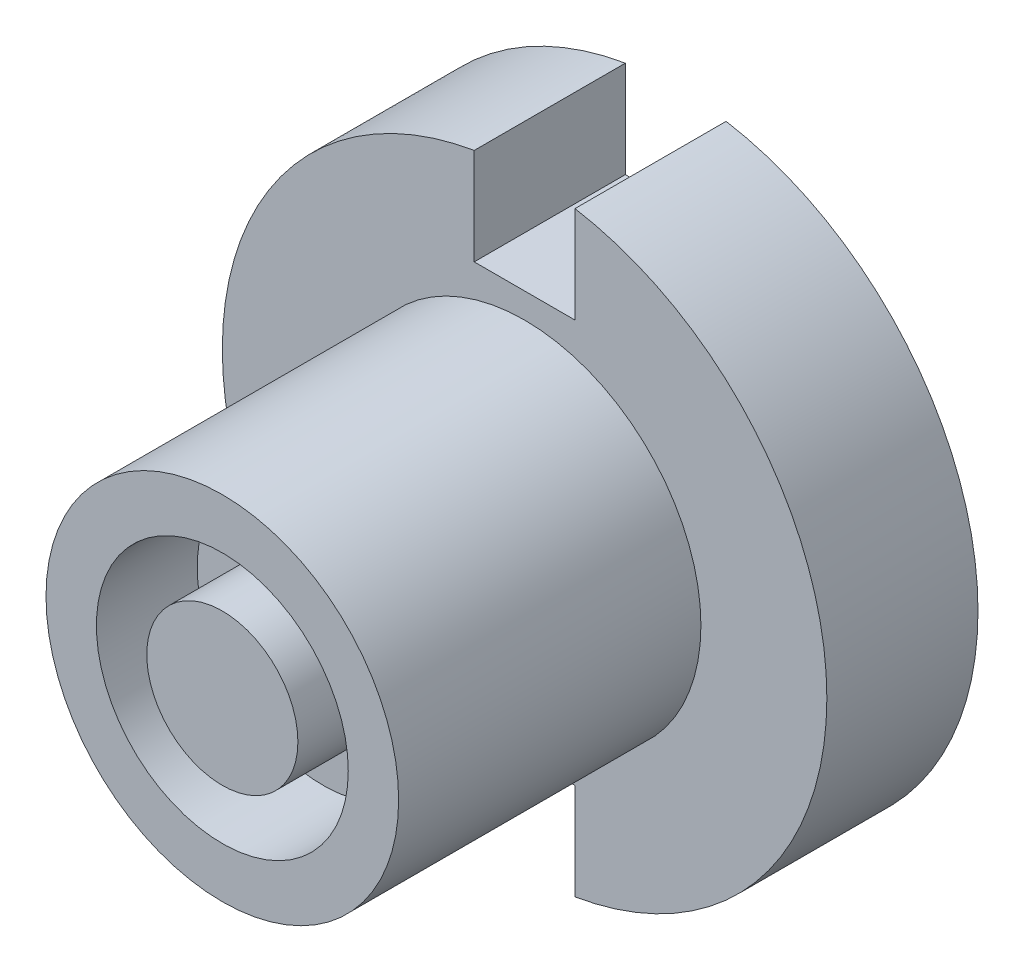
ISO-10303-21;
HEADER;
FILE_DESCRIPTION(('STEP AP214'),'2;1');
FILE_NAME('part.step','',(''),(''),'','','');
FILE_SCHEMA(('AUTOMOTIVE_DESIGN { 1 0 10303 214 1 1 1 1 }'));
ENDSEC;
DATA;
#1=APPLICATION_CONTEXT('core data for automotive mechanical design processes');
#2=APPLICATION_PROTOCOL_DEFINITION('international standard','automotive_design',2000,#1);
#3=PRODUCT_CONTEXT('',#1,'mechanical');
#4=PRODUCT('Part','Part','',(#3));
#5=PRODUCT_RELATED_PRODUCT_CATEGORY('part','',(#4));
#6=PRODUCT_DEFINITION_FORMATION('','',#4);
#7=PRODUCT_DEFINITION_CONTEXT('part definition',#1,'design');
#8=PRODUCT_DEFINITION('design','',#6,#7);
#9=PRODUCT_DEFINITION_SHAPE('','',#8);
#10=(LENGTH_UNIT() NAMED_UNIT(*) SI_UNIT(.MILLI.,.METRE.));
#11=(NAMED_UNIT(*) PLANE_ANGLE_UNIT() SI_UNIT($,.RADIAN.));
#12=(NAMED_UNIT(*) SI_UNIT($,.STERADIAN.) SOLID_ANGLE_UNIT());
#13=UNCERTAINTY_MEASURE_WITH_UNIT(LENGTH_MEASURE(1.E-05),#10,'distance_accuracy_value','');
#14=(GEOMETRIC_REPRESENTATION_CONTEXT(3) GLOBAL_UNCERTAINTY_ASSIGNED_CONTEXT((#13)) GLOBAL_UNIT_ASSIGNED_CONTEXT((#10,
#11,#12)) REPRESENTATION_CONTEXT('',''));
#15=CARTESIAN_POINT('',(0.,0.,0.));
#16=DIRECTION('',(0.,0.,1.));
#17=DIRECTION('',(1.,0.,0.));
#18=AXIS2_PLACEMENT_3D('',#15,#16,#17);
#19=CARTESIAN_POINT('',(-4.75410201159471,3.97833760996837,-3.));
#20=DIRECTION('',(0.,0.,1.));
#21=DIRECTION('',(1.,0.,0.));
#22=AXIS2_PLACEMENT_3D('',#19,#20,#21);
#23=CYLINDRICAL_SURFACE('',#22,6.);
#24=CARTESIAN_POINT('',(-4.75410201159471,3.97833760996837,0.));
#25=DIRECTION('',(0.,0.,-1.));
#26=DIRECTION('',(-1.,0.,0.));
#27=AXIS2_PLACEMENT_3D('',#24,#25,#26);
#28=CIRCLE('',#27,6.);
#29=CARTESIAN_POINT('',(-3.75410201159471,9.89441739306799,0.));
#30=VERTEX_POINT('',#29);
#31=CARTESIAN_POINT('',(-3.75410201159471,-1.93774217313124,0.));
#32=VERTEX_POINT('',#31);
#33=EDGE_CURVE('E169',#30,#32,#28,.T.);
#34=ORIENTED_EDGE('',*,*,#33,.T.);
#35=DIRECTION('',(0.,0.,1.));
#36=VECTOR('',#35,1.);
#37=CARTESIAN_POINT('',(-3.75410201159471,-1.93774217313124,-3.));
#38=LINE('',#37,#36);
#39=CARTESIAN_POINT('',(-3.75410201159471,-1.93774217313124,-3.));
#40=VERTEX_POINT('',#39);
#41=EDGE_CURVE('E48',#32,#40,#38,.F.);
#42=ORIENTED_EDGE('',*,*,#41,.T.);
#43=CARTESIAN_POINT('',(-4.75410201159471,3.97833760996837,-3.));
#44=DIRECTION('',(0.,0.,-1.));
#45=DIRECTION('',(-1.,0.,0.));
#46=AXIS2_PLACEMENT_3D('',#43,#44,#45);
#47=CIRCLE('',#46,6.);
#48=CARTESIAN_POINT('',(-3.75410201159471,9.89441739306799,-3.));
#49=VERTEX_POINT('',#48);
#50=EDGE_CURVE('E119',#49,#40,#47,.T.);
#51=ORIENTED_EDGE('',*,*,#50,.F.);
#52=DIRECTION('',(0.,0.,1.));
#53=VECTOR('',#52,1.);
#54=CARTESIAN_POINT('',(-3.75410201159471,9.89441739306799,-3.));
#55=LINE('',#54,#53);
#56=EDGE_CURVE('E151',#49,#30,#55,.T.);
#57=ORIENTED_EDGE('',*,*,#56,.T.);
#58=EDGE_LOOP('',(#34,#42,#51,#57));
#59=FACE_BOUND('',#58,.T.);
#60=ADVANCED_FACE('F33',(#59),#23,.T.);
#61=CARTESIAN_POINT('',(-4.75410201159471,3.97833760996837,6.));
#62=DIRECTION('',(0.,0.,-1.));
#63=DIRECTION('',(-1.,0.,0.));
#64=AXIS2_PLACEMENT_3D('',#61,#62,#63);
#65=CYLINDRICAL_SURFACE('',#64,3.5);
#66=CARTESIAN_POINT('',(-4.75410201159471,3.97833760996837,6.));
#67=DIRECTION('',(0.,0.,1.));
#68=DIRECTION('',(1.,0.,0.));
#69=AXIS2_PLACEMENT_3D('',#66,#67,#68);
#70=CIRCLE('',#69,3.5);
#71=CARTESIAN_POINT('',(-1.25410201159471,3.97833760996837,6.));
#72=VERTEX_POINT('',#71);
#73=EDGE_CURVE('E174',#72,#72,#70,.T.);
#74=ORIENTED_EDGE('',*,*,#73,.F.);
#75=EDGE_LOOP('',(#74));
#76=FACE_BOUND('',#75,.T.);
#77=CARTESIAN_POINT('',(-4.75410201159471,3.97833760996837,0.));
#78=DIRECTION('',(0.,0.,-1.));
#79=DIRECTION('',(-1.,0.,0.));
#80=AXIS2_PLACEMENT_3D('',#77,#78,#79);
#81=CIRCLE('',#80,3.5);
#82=CARTESIAN_POINT('',(-8.25410201159471,3.97833760996837,0.));
#83=VERTEX_POINT('',#82);
#84=EDGE_CURVE('E167',#83,#83,#81,.T.);
#85=ORIENTED_EDGE('',*,*,#84,.F.);
#86=EDGE_LOOP('',(#85));
#87=FACE_BOUND('',#86,.T.);
#88=ADVANCED_FACE('F35',(#76,#87),#65,.T.);
#89=CARTESIAN_POINT('',(-4.75410201159471,3.97833760996837,6.));
#90=DIRECTION('',(0.,0.,1.));
#91=DIRECTION('',(1.,0.,0.));
#92=AXIS2_PLACEMENT_3D('',#89,#90,#91);
#93=PLANE('',#92);
#94=CARTESIAN_POINT('',(-4.75410201159471,3.97833760996838,6.));
#95=DIRECTION('',(0.,0.,1.));
#96=DIRECTION('',(1.,0.,0.));
#97=AXIS2_PLACEMENT_3D('',#94,#95,#96);
#98=CIRCLE('',#97,2.5);
#99=CARTESIAN_POINT('',(-2.25410201159471,3.97833760996838,6.));
#100=VERTEX_POINT('',#99);
#101=EDGE_CURVE('E158',#100,#100,#98,.T.);
#102=ORIENTED_EDGE('',*,*,#101,.F.);
#103=EDGE_LOOP('',(#102));
#104=FACE_BOUND('',#103,.T.);
#105=ORIENTED_EDGE('',*,*,#73,.T.);
#106=EDGE_LOOP('',(#105));
#107=FACE_BOUND('',#106,.T.);
#108=ADVANCED_FACE('F207',(#104,#107),#93,.T.);
#109=CARTESIAN_POINT('',(-5.75410201159471,-1.93774217313124,-3.));
#110=VERTEX_POINT('',#109);
#111=CARTESIAN_POINT('',(-5.75410201159472,9.89441739306799,-3.));
#112=VERTEX_POINT('',#111);
#113=EDGE_CURVE('E168',#110,#112,#47,.T.);
#114=ORIENTED_EDGE('',*,*,#113,.F.);
#115=DIRECTION('',(0.,0.,1.));
#116=VECTOR('',#115,1.);
#117=CARTESIAN_POINT('',(-5.75410201159471,-1.93774217313124,-3.));
#118=LINE('',#117,#116);
#119=CARTESIAN_POINT('',(-5.75410201159471,-1.93774217313124,0.));
#120=VERTEX_POINT('',#119);
#121=EDGE_CURVE('E129',#110,#120,#118,.T.);
#122=ORIENTED_EDGE('',*,*,#121,.T.);
#123=CARTESIAN_POINT('',(-5.75410201159472,9.89441739306799,0.));
#124=VERTEX_POINT('',#123);
#125=EDGE_CURVE('E55',#120,#124,#28,.T.);
#126=ORIENTED_EDGE('',*,*,#125,.T.);
#127=DIRECTION('',(0.,0.,1.));
#128=VECTOR('',#127,1.);
#129=CARTESIAN_POINT('',(-5.75410201159472,9.89441739306799,-3.));
#130=LINE('',#129,#128);
#131=EDGE_CURVE('E147',#124,#112,#130,.F.);
#132=ORIENTED_EDGE('',*,*,#131,.T.);
#133=EDGE_LOOP('',(#114,#122,#126,#132));
#134=FACE_BOUND('',#133,.T.);
#135=ADVANCED_FACE('F190',(#134),#23,.T.);
#136=CARTESIAN_POINT('',(-4.75410201159471,3.97833760996837,-3.));
#137=DIRECTION('',(0.,0.,-1.));
#138=DIRECTION('',(-1.,0.,0.));
#139=AXIS2_PLACEMENT_3D('',#136,#137,#138);
#140=PLANE('',#139);
#141=DIRECTION('',(0.,-1.,0.));
#142=VECTOR('',#141,1.);
#143=CARTESIAN_POINT('',(-5.75410201159471,-0.0216623900316255,-3.));
#144=LINE('',#143,#142);
#145=CARTESIAN_POINT('',(-5.75410201159471,-0.0216623900316255,-3.));
#146=VERTEX_POINT('',#145);
#147=EDGE_CURVE('E106',#146,#110,#144,.T.);
#148=ORIENTED_EDGE('',*,*,#147,.T.);
#149=ORIENTED_EDGE('',*,*,#113,.T.);
#150=DIRECTION('',(0.,-1.,0.));
#151=VECTOR('',#150,1.);
#152=CARTESIAN_POINT('',(-5.75410201159471,7.97833760996837,-3.));
#153=LINE('',#152,#151);
#154=CARTESIAN_POINT('',(-5.75410201159471,7.97833760996837,-3.));
#155=VERTEX_POINT('',#154);
#156=EDGE_CURVE('E132',#112,#155,#153,.T.);
#157=ORIENTED_EDGE('',*,*,#156,.T.);
#158=DIRECTION('',(1.,0.,0.));
#159=VECTOR('',#158,1.);
#160=CARTESIAN_POINT('',(-5.75410201159471,7.97833760996837,-3.));
#161=LINE('',#160,#159);
#162=CARTESIAN_POINT('',(-3.75410201159471,7.97833760996837,-3.));
#163=VERTEX_POINT('',#162);
#164=EDGE_CURVE('E135',#155,#163,#161,.T.);
#165=ORIENTED_EDGE('',*,*,#164,.T.);
#166=DIRECTION('',(0.,1.,0.));
#167=VECTOR('',#166,1.);
#168=CARTESIAN_POINT('',(-3.75410201159471,7.97833760996837,-3.));
#169=LINE('',#168,#167);
#170=EDGE_CURVE('E139',#163,#49,#169,.T.);
#171=ORIENTED_EDGE('',*,*,#170,.T.);
#172=ORIENTED_EDGE('',*,*,#50,.T.);
#173=DIRECTION('',(0.,1.,0.));
#174=VECTOR('',#173,1.);
#175=CARTESIAN_POINT('',(-3.75410201159471,-0.0216623900316252,-3.));
#176=LINE('',#175,#174);
#177=CARTESIAN_POINT('',(-3.75410201159471,-0.0216623900316252,-3.));
#178=VERTEX_POINT('',#177);
#179=EDGE_CURVE('E101',#40,#178,#176,.T.);
#180=ORIENTED_EDGE('',*,*,#179,.T.);
#181=DIRECTION('',(-1.,0.,0.));
#182=VECTOR('',#181,1.);
#183=CARTESIAN_POINT('',(-5.75410201159471,-0.0216623900316255,-3.));
#184=LINE('',#183,#182);
#185=EDGE_CURVE('E109',#178,#146,#184,.T.);
#186=ORIENTED_EDGE('',*,*,#185,.T.);
#187=EDGE_LOOP('',(#148,#149,#157,#165,#171,#172,#180,#186));
#188=FACE_BOUND('',#187,.T.);
#189=ADVANCED_FACE('F116',(#188),#140,.T.);
#190=CARTESIAN_POINT('',(-4.75410201159471,3.97833760996837,0.));
#191=DIRECTION('',(0.,0.,-1.));
#192=DIRECTION('',(-1.,0.,0.));
#193=AXIS2_PLACEMENT_3D('',#190,#191,#192);
#194=PLANE('',#193);
#195=ORIENTED_EDGE('',*,*,#84,.T.);
#196=EDGE_LOOP('',(#195));
#197=FACE_BOUND('',#196,.T.);
#198=ORIENTED_EDGE('',*,*,#125,.F.);
#199=DIRECTION('',(0.,-1.,0.));
#200=VECTOR('',#199,1.);
#201=CARTESIAN_POINT('',(-5.75410201159471,-0.0216623900316255,0.));
#202=LINE('',#201,#200);
#203=CARTESIAN_POINT('',(-5.75410201159471,-0.0216623900316255,0.));
#204=VERTEX_POINT('',#203);
#205=EDGE_CURVE('E120',#204,#120,#202,.T.);
#206=ORIENTED_EDGE('',*,*,#205,.F.);
#207=DIRECTION('',(-1.,0.,0.));
#208=VECTOR('',#207,1.);
#209=CARTESIAN_POINT('',(-5.75410201159471,-0.0216623900316255,0.));
#210=LINE('',#209,#208);
#211=CARTESIAN_POINT('',(-3.75410201159471,-0.0216623900316252,0.));
#212=VERTEX_POINT('',#211);
#213=EDGE_CURVE('E122',#212,#204,#210,.T.);
#214=ORIENTED_EDGE('',*,*,#213,.F.);
#215=DIRECTION('',(0.,-1.,0.));
#216=VECTOR('',#215,1.);
#217=CARTESIAN_POINT('',(-3.75410201159471,3.97833760996837,0.));
#218=LINE('',#217,#216);
#219=EDGE_CURVE('E11',#212,#32,#218,.T.);
#220=ORIENTED_EDGE('',*,*,#219,.T.);
#221=ORIENTED_EDGE('',*,*,#33,.F.);
#222=DIRECTION('',(0.,1.,0.));
#223=VECTOR('',#222,1.);
#224=CARTESIAN_POINT('',(-3.75410201159471,7.97833760996837,0.));
#225=LINE('',#224,#223);
#226=CARTESIAN_POINT('',(-3.75410201159471,7.97833760996837,0.));
#227=VERTEX_POINT('',#226);
#228=EDGE_CURVE('E136',#227,#30,#225,.T.);
#229=ORIENTED_EDGE('',*,*,#228,.F.);
#230=DIRECTION('',(1.,0.,0.));
#231=VECTOR('',#230,1.);
#232=CARTESIAN_POINT('',(-5.75410201159471,7.97833760996837,0.));
#233=LINE('',#232,#231);
#234=CARTESIAN_POINT('',(-5.75410201159471,7.97833760996837,0.));
#235=VERTEX_POINT('',#234);
#236=EDGE_CURVE('E131',#235,#227,#233,.T.);
#237=ORIENTED_EDGE('',*,*,#236,.F.);
#238=DIRECTION('',(0.,1.,0.));
#239=VECTOR('',#238,1.);
#240=CARTESIAN_POINT('',(-5.75410201159471,3.97833760996837,0.));
#241=LINE('',#240,#239);
#242=EDGE_CURVE('E41',#235,#124,#241,.T.);
#243=ORIENTED_EDGE('',*,*,#242,.T.);
#244=EDGE_LOOP('',(#198,#206,#214,#220,#221,#229,#237,#243));
#245=FACE_BOUND('',#244,.T.);
#246=ADVANCED_FACE('F179',(#197,#245),#194,.F.);
#247=CARTESIAN_POINT('',(-4.75410201159471,3.97833760996838,4.));
#248=DIRECTION('',(0.,0.,1.));
#249=DIRECTION('',(1.,0.,0.));
#250=AXIS2_PLACEMENT_3D('',#247,#248,#249);
#251=CYLINDRICAL_SURFACE('',#250,2.5);
#252=CARTESIAN_POINT('',(-4.75410201159471,3.97833760996838,4.));
#253=DIRECTION('',(0.,0.,1.));
#254=DIRECTION('',(1.,0.,0.));
#255=AXIS2_PLACEMENT_3D('',#252,#253,#254);
#256=CIRCLE('',#255,2.5);
#257=CARTESIAN_POINT('',(-2.25410201159471,3.97833760996838,4.));
#258=VERTEX_POINT('',#257);
#259=EDGE_CURVE('E161',#258,#258,#256,.T.);
#260=ORIENTED_EDGE('',*,*,#259,.F.);
#261=EDGE_LOOP('',(#260));
#262=FACE_BOUND('',#261,.T.);
#263=ORIENTED_EDGE('',*,*,#101,.T.);
#264=EDGE_LOOP('',(#263));
#265=FACE_BOUND('',#264,.T.);
#266=ADVANCED_FACE('F233',(#262,#265),#251,.F.);
#267=CARTESIAN_POINT('',(-4.75410201159471,3.97833760996838,4.));
#268=DIRECTION('',(0.,0.,1.));
#269=DIRECTION('',(1.,0.,0.));
#270=AXIS2_PLACEMENT_3D('',#267,#268,#269);
#271=PLANE('',#270);
#272=CARTESIAN_POINT('',(-4.75410201159471,3.97833760996838,4.));
#273=DIRECTION('',(0.,0.,1.));
#274=DIRECTION('',(1.,0.,0.));
#275=AXIS2_PLACEMENT_3D('',#272,#273,#274);
#276=CIRCLE('',#275,1.5);
#277=CARTESIAN_POINT('',(-3.25410201159471,3.97833760996838,4.));
#278=VERTEX_POINT('',#277);
#279=EDGE_CURVE('E155',#278,#278,#276,.T.);
#280=ORIENTED_EDGE('',*,*,#279,.F.);
#281=EDGE_LOOP('',(#280));
#282=FACE_BOUND('',#281,.T.);
#283=ORIENTED_EDGE('',*,*,#259,.T.);
#284=EDGE_LOOP('',(#283));
#285=FACE_BOUND('',#284,.T.);
#286=ADVANCED_FACE('F237',(#282,#285),#271,.T.);
#287=CARTESIAN_POINT('',(-4.75410201159471,3.97833760996838,4.));
#288=DIRECTION('',(0.,0.,1.));
#289=DIRECTION('',(1.,0.,0.));
#290=AXIS2_PLACEMENT_3D('',#287,#288,#289);
#291=CYLINDRICAL_SURFACE('',#290,1.5);
#292=ORIENTED_EDGE('',*,*,#279,.T.);
#293=EDGE_LOOP('',(#292));
#294=FACE_BOUND('',#293,.T.);
#295=CARTESIAN_POINT('',(-4.75410201159471,3.97833760996838,6.));
#296=DIRECTION('',(0.,0.,1.));
#297=DIRECTION('',(1.,0.,0.));
#298=AXIS2_PLACEMENT_3D('',#295,#296,#297);
#299=CIRCLE('',#298,1.5);
#300=CARTESIAN_POINT('',(-3.25410201159471,3.97833760996838,6.));
#301=VERTEX_POINT('',#300);
#302=EDGE_CURVE('E154',#301,#301,#299,.T.);
#303=ORIENTED_EDGE('',*,*,#302,.F.);
#304=EDGE_LOOP('',(#303));
#305=FACE_BOUND('',#304,.T.);
#306=ADVANCED_FACE('F205',(#294,#305),#291,.T.);
#307=ORIENTED_EDGE('',*,*,#302,.T.);
#308=EDGE_LOOP('',(#307));
#309=FACE_BOUND('',#308,.T.);
#310=ADVANCED_FACE('F198',(#309),#93,.T.);
#311=CARTESIAN_POINT('',(-3.75410201159471,7.97833760996837,-3.));
#312=DIRECTION('',(1.,0.,0.));
#313=DIRECTION('',(0.,1.,0.));
#314=AXIS2_PLACEMENT_3D('',#311,#312,#313);
#315=PLANE('',#314);
#316=ORIENTED_EDGE('',*,*,#170,.F.);
#317=DIRECTION('',(0.,0.,1.));
#318=VECTOR('',#317,1.);
#319=CARTESIAN_POINT('',(-3.75410201159471,7.97833760996837,-3.));
#320=LINE('',#319,#318);
#321=EDGE_CURVE('E145',#163,#227,#320,.T.);
#322=ORIENTED_EDGE('',*,*,#321,.T.);
#323=ORIENTED_EDGE('',*,*,#228,.T.);
#324=ORIENTED_EDGE('',*,*,#56,.F.);
#325=EDGE_LOOP('',(#316,#322,#323,#324));
#326=FACE_BOUND('',#325,.T.);
#327=ADVANCED_FACE('F196',(#326),#315,.F.);
#328=CARTESIAN_POINT('',(-5.75410201159471,7.97833760996837,-3.));
#329=DIRECTION('',(-1.,0.,0.));
#330=DIRECTION('',(0.,-1.,0.));
#331=AXIS2_PLACEMENT_3D('',#328,#329,#330);
#332=PLANE('',#331);
#333=ORIENTED_EDGE('',*,*,#242,.F.);
#334=DIRECTION('',(0.,0.,1.));
#335=VECTOR('',#334,1.);
#336=CARTESIAN_POINT('',(-5.75410201159471,7.97833760996837,-3.));
#337=LINE('',#336,#335);
#338=EDGE_CURVE('E141',#155,#235,#337,.T.);
#339=ORIENTED_EDGE('',*,*,#338,.F.);
#340=ORIENTED_EDGE('',*,*,#156,.F.);
#341=ORIENTED_EDGE('',*,*,#131,.F.);
#342=EDGE_LOOP('',(#333,#339,#340,#341));
#343=FACE_BOUND('',#342,.T.);
#344=ADVANCED_FACE('F183',(#343),#332,.F.);
#345=CARTESIAN_POINT('',(-5.75410201159471,7.97833760996837,-3.));
#346=DIRECTION('',(0.,-1.,0.));
#347=DIRECTION('',(0.,0.,-1.));
#348=AXIS2_PLACEMENT_3D('',#345,#346,#347);
#349=PLANE('',#348);
#350=ORIENTED_EDGE('',*,*,#236,.T.);
#351=ORIENTED_EDGE('',*,*,#321,.F.);
#352=ORIENTED_EDGE('',*,*,#164,.F.);
#353=ORIENTED_EDGE('',*,*,#338,.T.);
#354=EDGE_LOOP('',(#350,#351,#352,#353));
#355=FACE_BOUND('',#354,.T.);
#356=ADVANCED_FACE('F187',(#355),#349,.F.);
#357=CARTESIAN_POINT('',(-5.75410201159471,-0.0216623900316255,-3.));
#358=DIRECTION('',(-1.,0.,0.));
#359=DIRECTION('',(0.,-1.,0.));
#360=AXIS2_PLACEMENT_3D('',#357,#358,#359);
#361=PLANE('',#360);
#362=ORIENTED_EDGE('',*,*,#147,.F.);
#363=DIRECTION('',(0.,0.,1.));
#364=VECTOR('',#363,1.);
#365=CARTESIAN_POINT('',(-5.75410201159471,-0.0216623900316255,-3.));
#366=LINE('',#365,#364);
#367=EDGE_CURVE('E105',#146,#204,#366,.T.);
#368=ORIENTED_EDGE('',*,*,#367,.T.);
#369=ORIENTED_EDGE('',*,*,#205,.T.);
#370=ORIENTED_EDGE('',*,*,#121,.F.);
#371=EDGE_LOOP('',(#362,#368,#369,#370));
#372=FACE_BOUND('',#371,.T.);
#373=ADVANCED_FACE('F192',(#372),#361,.F.);
#374=CARTESIAN_POINT('',(-3.75410201159471,-0.0216623900316252,-3.));
#375=DIRECTION('',(1.,0.,0.));
#376=DIRECTION('',(0.,1.,0.));
#377=AXIS2_PLACEMENT_3D('',#374,#375,#376);
#378=PLANE('',#377);
#379=ORIENTED_EDGE('',*,*,#219,.F.);
#380=DIRECTION('',(0.,0.,1.));
#381=VECTOR('',#380,1.);
#382=CARTESIAN_POINT('',(-3.75410201159471,-0.0216623900316252,-3.));
#383=LINE('',#382,#381);
#384=EDGE_CURVE('E97',#178,#212,#383,.T.);
#385=ORIENTED_EDGE('',*,*,#384,.F.);
#386=ORIENTED_EDGE('',*,*,#179,.F.);
#387=ORIENTED_EDGE('',*,*,#41,.F.);
#388=EDGE_LOOP('',(#379,#385,#386,#387));
#389=FACE_BOUND('',#388,.T.);
#390=ADVANCED_FACE('F99',(#389),#378,.F.);
#391=CARTESIAN_POINT('',(-5.75410201159471,-0.0216623900316255,-3.));
#392=DIRECTION('',(0.,1.,0.));
#393=DIRECTION('',(-1.,0.,0.));
#394=AXIS2_PLACEMENT_3D('',#391,#392,#393);
#395=PLANE('',#394);
#396=ORIENTED_EDGE('',*,*,#213,.T.);
#397=ORIENTED_EDGE('',*,*,#367,.F.);
#398=ORIENTED_EDGE('',*,*,#185,.F.);
#399=ORIENTED_EDGE('',*,*,#384,.T.);
#400=EDGE_LOOP('',(#396,#397,#398,#399));
#401=FACE_BOUND('',#400,.T.);
#402=ADVANCED_FACE('F110',(#401),#395,.F.);
#403=CLOSED_SHELL('',(#60,#88,#108,#135,#189,#246,#266,#286,#306,#310,#327,#344,#356,#373,#390,#402));
#404=MANIFOLD_SOLID_BREP('B2',#403);
#405=ADVANCED_BREP_SHAPE_REPRESENTATION('',(#18,#404),#14);
#406=SHAPE_DEFINITION_REPRESENTATION(#9,#405);
ENDSEC;
END-ISO-10303-21;
